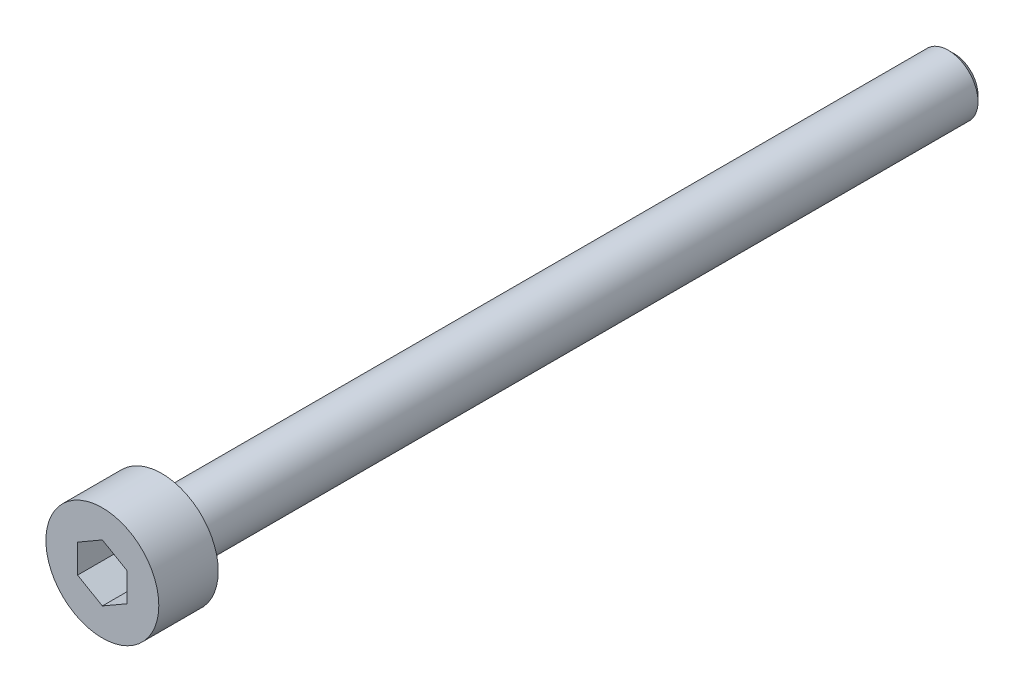
ISO-10303-21;
HEADER;
FILE_DESCRIPTION(('STEP AP214'),'2;1');
FILE_NAME('part.step','',(''),(''),'','','');
FILE_SCHEMA(('AUTOMOTIVE_DESIGN { 1 0 10303 214 1 1 1 1 }'));
ENDSEC;
DATA;
#1=APPLICATION_CONTEXT('core data for automotive mechanical design processes');
#2=APPLICATION_PROTOCOL_DEFINITION('international standard','automotive_design',2000,#1);
#3=PRODUCT_CONTEXT('',#1,'mechanical');
#4=PRODUCT('Part','Part','',(#3));
#5=PRODUCT_RELATED_PRODUCT_CATEGORY('part','',(#4));
#6=PRODUCT_DEFINITION_FORMATION('','',#4);
#7=PRODUCT_DEFINITION_CONTEXT('part definition',#1,'design');
#8=PRODUCT_DEFINITION('design','',#6,#7);
#9=PRODUCT_DEFINITION_SHAPE('','',#8);
#10=(LENGTH_UNIT() NAMED_UNIT(*) SI_UNIT(.MILLI.,.METRE.));
#11=(NAMED_UNIT(*) PLANE_ANGLE_UNIT() SI_UNIT($,.RADIAN.));
#12=(NAMED_UNIT(*) SI_UNIT($,.STERADIAN.) SOLID_ANGLE_UNIT());
#13=UNCERTAINTY_MEASURE_WITH_UNIT(LENGTH_MEASURE(1.E-05),#10,'distance_accuracy_value','');
#14=(GEOMETRIC_REPRESENTATION_CONTEXT(3) GLOBAL_UNCERTAINTY_ASSIGNED_CONTEXT((#13)) GLOBAL_UNIT_ASSIGNED_CONTEXT((#10,
#11,#12)) REPRESENTATION_CONTEXT('',''));
#15=CARTESIAN_POINT('',(0.,0.,0.));
#16=DIRECTION('',(0.,0.,1.));
#17=DIRECTION('',(1.,0.,0.));
#18=AXIS2_PLACEMENT_3D('',#15,#16,#17);
#19=CARTESIAN_POINT('',(0.,0.,0.));
#20=DIRECTION('',(0.,0.,1.));
#21=DIRECTION('',(1.,0.,0.));
#22=AXIS2_PLACEMENT_3D('',#19,#20,#21);
#23=PLANE('',#22);
#24=CARTESIAN_POINT('',(0.,0.,0.));
#25=DIRECTION('',(0.,0.,1.));
#26=DIRECTION('',(1.,0.,0.));
#27=AXIS2_PLACEMENT_3D('',#24,#25,#26);
#28=CIRCLE('',#27,2.85);
#29=CARTESIAN_POINT('',(2.85,0.,0.));
#30=VERTEX_POINT('',#29);
#31=EDGE_CURVE('E136',#30,#30,#28,.T.);
#32=ORIENTED_EDGE('',*,*,#31,.F.);
#33=EDGE_LOOP('',(#32));
#34=FACE_BOUND('',#33,.T.);
#35=CARTESIAN_POINT('',(0.,0.,0.));
#36=DIRECTION('',(0.,0.,1.));
#37=DIRECTION('',(1.,0.,0.));
#38=AXIS2_PLACEMENT_3D('',#35,#36,#37);
#39=CIRCLE('',#38,1.5);
#40=CARTESIAN_POINT('',(1.5,0.,0.));
#41=VERTEX_POINT('',#40);
#42=EDGE_CURVE('E145',#41,#41,#39,.F.);
#43=ORIENTED_EDGE('',*,*,#42,.F.);
#44=EDGE_LOOP('',(#43));
#45=FACE_BOUND('',#44,.T.);
#46=ADVANCED_FACE('F34',(#34,#45),#23,.F.);
#47=CARTESIAN_POINT('',(0.,0.,3.));
#48=DIRECTION('',(0.,0.,-1.));
#49=DIRECTION('',(-1.,0.,0.));
#50=AXIS2_PLACEMENT_3D('',#47,#48,#49);
#51=CYLINDRICAL_SURFACE('',#50,2.85);
#52=CARTESIAN_POINT('',(0.,0.,3.));
#53=DIRECTION('',(0.,0.,1.));
#54=DIRECTION('',(1.,0.,0.));
#55=AXIS2_PLACEMENT_3D('',#52,#53,#54);
#56=CIRCLE('',#55,2.85);
#57=CARTESIAN_POINT('',(2.85,0.,3.));
#58=VERTEX_POINT('',#57);
#59=EDGE_CURVE('E142',#58,#58,#56,.T.);
#60=ORIENTED_EDGE('',*,*,#59,.F.);
#61=EDGE_LOOP('',(#60));
#62=FACE_BOUND('',#61,.T.);
#63=ORIENTED_EDGE('',*,*,#31,.T.);
#64=EDGE_LOOP('',(#63));
#65=FACE_BOUND('',#64,.T.);
#66=ADVANCED_FACE('F167',(#62,#65),#51,.T.);
#67=CARTESIAN_POINT('',(0.,0.,3.));
#68=DIRECTION('',(0.,0.,1.));
#69=DIRECTION('',(1.,0.,0.));
#70=AXIS2_PLACEMENT_3D('',#67,#68,#69);
#71=PLANE('',#70);
#72=DIRECTION('',(-0.866025403784439,0.5,0.));
#73=VECTOR('',#72,1.);
#74=CARTESIAN_POINT('',(1.25,0.721687836487032,3.));
#75=LINE('',#74,#73);
#76=CARTESIAN_POINT('',(1.25,0.721687836487032,3.));
#77=VERTEX_POINT('',#76);
#78=CARTESIAN_POINT('',(0.,1.44337567297406,3.));
#79=VERTEX_POINT('',#78);
#80=EDGE_CURVE('E49',#77,#79,#75,.T.);
#81=ORIENTED_EDGE('',*,*,#80,.F.);
#82=DIRECTION('',(0.,1.,0.));
#83=VECTOR('',#82,1.);
#84=CARTESIAN_POINT('',(1.25,-0.721687836487032,3.));
#85=LINE('',#84,#83);
#86=CARTESIAN_POINT('',(1.25,-0.721687836487032,3.));
#87=VERTEX_POINT('',#86);
#88=EDGE_CURVE('E132',#87,#77,#85,.T.);
#89=ORIENTED_EDGE('',*,*,#88,.F.);
#90=DIRECTION('',(0.866025403784439,0.5,0.));
#91=VECTOR('',#90,1.);
#92=CARTESIAN_POINT('',(0.,-1.44337567297406,3.));
#93=LINE('',#92,#91);
#94=CARTESIAN_POINT('',(0.,-1.44337567297406,3.));
#95=VERTEX_POINT('',#94);
#96=EDGE_CURVE('E130',#95,#87,#93,.T.);
#97=ORIENTED_EDGE('',*,*,#96,.F.);
#98=DIRECTION('',(0.866025403784439,-0.5,0.));
#99=VECTOR('',#98,1.);
#100=CARTESIAN_POINT('',(-1.25,-0.721687836487033,3.));
#101=LINE('',#100,#99);
#102=CARTESIAN_POINT('',(-1.25,-0.721687836487033,3.));
#103=VERTEX_POINT('',#102);
#104=EDGE_CURVE('E97',#103,#95,#101,.T.);
#105=ORIENTED_EDGE('',*,*,#104,.F.);
#106=DIRECTION('',(0.,-1.,0.));
#107=VECTOR('',#106,1.);
#108=CARTESIAN_POINT('',(-1.25,0.721687836487032,3.));
#109=LINE('',#108,#107);
#110=CARTESIAN_POINT('',(-1.25,0.721687836487032,3.));
#111=VERTEX_POINT('',#110);
#112=EDGE_CURVE('E126',#111,#103,#109,.T.);
#113=ORIENTED_EDGE('',*,*,#112,.F.);
#114=DIRECTION('',(-0.866025403784439,-0.5,0.));
#115=VECTOR('',#114,1.);
#116=CARTESIAN_POINT('',(0.,1.44337567297406,3.));
#117=LINE('',#116,#115);
#118=EDGE_CURVE('E123',#79,#111,#117,.T.);
#119=ORIENTED_EDGE('',*,*,#118,.F.);
#120=EDGE_LOOP('',(#81,#89,#97,#105,#113,#119));
#121=FACE_BOUND('',#120,.T.);
#122=ORIENTED_EDGE('',*,*,#59,.T.);
#123=EDGE_LOOP('',(#122));
#124=FACE_BOUND('',#123,.T.);
#125=ADVANCED_FACE('F173',(#121,#124),#71,.T.);
#126=CARTESIAN_POINT('',(0.,0.,-40.));
#127=DIRECTION('',(0.,0.,1.));
#128=DIRECTION('',(1.,0.,0.));
#129=AXIS2_PLACEMENT_3D('',#126,#127,#128);
#130=CYLINDRICAL_SURFACE('',#129,1.5);
#131=CARTESIAN_POINT('',(0.,0.,-39.7));
#132=DIRECTION('',(0.,0.,-1.));
#133=DIRECTION('',(-1.,0.,0.));
#134=AXIS2_PLACEMENT_3D('',#131,#132,#133);
#135=CIRCLE('',#134,1.5);
#136=CARTESIAN_POINT('',(-1.5,0.,-39.7));
#137=VERTEX_POINT('',#136);
#138=EDGE_CURVE('E11',#137,#137,#135,.F.);
#139=ORIENTED_EDGE('',*,*,#138,.T.);
#140=EDGE_LOOP('',(#139));
#141=FACE_BOUND('',#140,.T.);
#142=ORIENTED_EDGE('',*,*,#42,.T.);
#143=EDGE_LOOP('',(#142));
#144=FACE_BOUND('',#143,.T.);
#145=ADVANCED_FACE('F163',(#141,#144),#130,.T.);
#146=CARTESIAN_POINT('',(0.,0.,-40.));
#147=DIRECTION('',(0.,0.,-1.));
#148=DIRECTION('',(-1.,0.,0.));
#149=AXIS2_PLACEMENT_3D('',#146,#147,#148);
#150=PLANE('',#149);
#151=CARTESIAN_POINT('',(0.,0.,-40.));
#152=DIRECTION('',(0.,0.,-1.));
#153=DIRECTION('',(-1.,0.,0.));
#154=AXIS2_PLACEMENT_3D('',#151,#152,#153);
#155=CIRCLE('',#154,1.2);
#156=CARTESIAN_POINT('',(-1.2,0.,-40.));
#157=VERTEX_POINT('',#156);
#158=EDGE_CURVE('E42',#157,#157,#155,.T.);
#159=ORIENTED_EDGE('',*,*,#158,.T.);
#160=EDGE_LOOP('',(#159));
#161=FACE_BOUND('',#160,.T.);
#162=ADVANCED_FACE('F152',(#161),#150,.T.);
#163=CARTESIAN_POINT('',(0.,0.,-40.));
#164=DIRECTION('',(0.,0.,1.));
#165=DIRECTION('',(1.,0.,0.));
#166=AXIS2_PLACEMENT_3D('',#163,#164,#165);
#167=CONICAL_SURFACE('',#166,1.2,0.785398163397423);
#168=ORIENTED_EDGE('',*,*,#138,.F.);
#169=EDGE_LOOP('',(#168));
#170=FACE_BOUND('',#169,.T.);
#171=ORIENTED_EDGE('',*,*,#158,.F.);
#172=EDGE_LOOP('',(#171));
#173=FACE_BOUND('',#172,.T.);
#174=ADVANCED_FACE('F36',(#170,#173),#167,.T.);
#175=CARTESIAN_POINT('',(1.25,0.721687836487032,1.));
#176=DIRECTION('',(0.5,0.866025403784439,0.));
#177=DIRECTION('',(-0.866025403784439,0.5,0.));
#178=AXIS2_PLACEMENT_3D('',#175,#176,#177);
#179=PLANE('',#178);
#180=ORIENTED_EDGE('',*,*,#80,.T.);
#181=DIRECTION('',(0.,0.,1.));
#182=VECTOR('',#181,1.);
#183=CARTESIAN_POINT('',(0.,1.44337567297406,1.));
#184=LINE('',#183,#182);
#185=CARTESIAN_POINT('',(0.,1.44337567297406,1.));
#186=VERTEX_POINT('',#185);
#187=EDGE_CURVE('E79',#186,#79,#184,.T.);
#188=ORIENTED_EDGE('',*,*,#187,.F.);
#189=DIRECTION('',(-0.866025403784439,0.5,0.));
#190=VECTOR('',#189,1.);
#191=CARTESIAN_POINT('',(1.25,0.721687836487032,1.));
#192=LINE('',#191,#190);
#193=CARTESIAN_POINT('',(1.25,0.721687836487032,1.));
#194=VERTEX_POINT('',#193);
#195=EDGE_CURVE('E134',#194,#186,#192,.T.);
#196=ORIENTED_EDGE('',*,*,#195,.F.);
#197=DIRECTION('',(0.,0.,1.));
#198=VECTOR('',#197,1.);
#199=CARTESIAN_POINT('',(1.25,0.721687836487032,1.));
#200=LINE('',#199,#198);
#201=EDGE_CURVE('E57',#194,#77,#200,.T.);
#202=ORIENTED_EDGE('',*,*,#201,.T.);
#203=EDGE_LOOP('',(#180,#188,#196,#202));
#204=FACE_BOUND('',#203,.T.);
#205=ADVANCED_FACE('F155',(#204),#179,.F.);
#206=CARTESIAN_POINT('',(1.25,-0.721687836487032,1.));
#207=DIRECTION('',(1.,0.,0.));
#208=DIRECTION('',(0.,1.,0.));
#209=AXIS2_PLACEMENT_3D('',#206,#207,#208);
#210=PLANE('',#209);
#211=ORIENTED_EDGE('',*,*,#88,.T.);
#212=ORIENTED_EDGE('',*,*,#201,.F.);
#213=DIRECTION('',(0.,1.,0.));
#214=VECTOR('',#213,1.);
#215=CARTESIAN_POINT('',(1.25,-0.721687836487032,1.));
#216=LINE('',#215,#214);
#217=CARTESIAN_POINT('',(1.25,-0.721687836487032,1.));
#218=VERTEX_POINT('',#217);
#219=EDGE_CURVE('E109',#218,#194,#216,.T.);
#220=ORIENTED_EDGE('',*,*,#219,.F.);
#221=DIRECTION('',(0.,0.,1.));
#222=VECTOR('',#221,1.);
#223=CARTESIAN_POINT('',(1.25,-0.721687836487032,1.));
#224=LINE('',#223,#222);
#225=EDGE_CURVE('E101',#218,#87,#224,.T.);
#226=ORIENTED_EDGE('',*,*,#225,.T.);
#227=EDGE_LOOP('',(#211,#212,#220,#226));
#228=FACE_BOUND('',#227,.T.);
#229=ADVANCED_FACE('F161',(#228),#210,.F.);
#230=CARTESIAN_POINT('',(0.,-1.44337567297406,1.));
#231=DIRECTION('',(0.5,-0.866025403784439,0.));
#232=DIRECTION('',(0.866025403784439,0.5,0.));
#233=AXIS2_PLACEMENT_3D('',#230,#231,#232);
#234=PLANE('',#233);
#235=ORIENTED_EDGE('',*,*,#96,.T.);
#236=ORIENTED_EDGE('',*,*,#225,.F.);
#237=DIRECTION('',(0.866025403784439,0.5,0.));
#238=VECTOR('',#237,1.);
#239=CARTESIAN_POINT('',(0.,-1.44337567297406,1.));
#240=LINE('',#239,#238);
#241=CARTESIAN_POINT('',(0.,-1.44337567297406,1.));
#242=VERTEX_POINT('',#241);
#243=EDGE_CURVE('E105',#242,#218,#240,.T.);
#244=ORIENTED_EDGE('',*,*,#243,.F.);
#245=DIRECTION('',(0.,0.,1.));
#246=VECTOR('',#245,1.);
#247=CARTESIAN_POINT('',(0.,-1.44337567297406,1.));
#248=LINE('',#247,#246);
#249=EDGE_CURVE('E90',#242,#95,#248,.T.);
#250=ORIENTED_EDGE('',*,*,#249,.T.);
#251=EDGE_LOOP('',(#235,#236,#244,#250));
#252=FACE_BOUND('',#251,.T.);
#253=ADVANCED_FACE('F106',(#252),#234,.F.);
#254=CARTESIAN_POINT('',(-1.25,-0.721687836487033,1.));
#255=DIRECTION('',(-0.5,-0.866025403784439,0.));
#256=DIRECTION('',(0.866025403784439,-0.5,0.));
#257=AXIS2_PLACEMENT_3D('',#254,#255,#256);
#258=PLANE('',#257);
#259=ORIENTED_EDGE('',*,*,#104,.T.);
#260=ORIENTED_EDGE('',*,*,#249,.F.);
#261=DIRECTION('',(0.866025403784439,-0.5,0.));
#262=VECTOR('',#261,1.);
#263=CARTESIAN_POINT('',(-1.25,-0.721687836487033,1.));
#264=LINE('',#263,#262);
#265=CARTESIAN_POINT('',(-1.25,-0.721687836487033,1.));
#266=VERTEX_POINT('',#265);
#267=EDGE_CURVE('E94',#266,#242,#264,.T.);
#268=ORIENTED_EDGE('',*,*,#267,.F.);
#269=DIRECTION('',(0.,0.,1.));
#270=VECTOR('',#269,1.);
#271=CARTESIAN_POINT('',(-1.25,-0.721687836487033,1.));
#272=LINE('',#271,#270);
#273=EDGE_CURVE('E102',#266,#103,#272,.T.);
#274=ORIENTED_EDGE('',*,*,#273,.T.);
#275=EDGE_LOOP('',(#259,#260,#268,#274));
#276=FACE_BOUND('',#275,.T.);
#277=ADVANCED_FACE('F92',(#276),#258,.F.);
#278=CARTESIAN_POINT('',(-1.25,0.721687836487032,1.));
#279=DIRECTION('',(-1.,0.,0.));
#280=DIRECTION('',(0.,0.,1.));
#281=AXIS2_PLACEMENT_3D('',#278,#279,#280);
#282=PLANE('',#281);
#283=ORIENTED_EDGE('',*,*,#112,.T.);
#284=ORIENTED_EDGE('',*,*,#273,.F.);
#285=DIRECTION('',(0.,-1.,0.));
#286=VECTOR('',#285,1.);
#287=CARTESIAN_POINT('',(-1.25,0.721687836487032,1.));
#288=LINE('',#287,#286);
#289=CARTESIAN_POINT('',(-1.25,0.721687836487032,1.));
#290=VERTEX_POINT('',#289);
#291=EDGE_CURVE('E115',#290,#266,#288,.T.);
#292=ORIENTED_EDGE('',*,*,#291,.F.);
#293=DIRECTION('',(0.,0.,1.));
#294=VECTOR('',#293,1.);
#295=CARTESIAN_POINT('',(-1.25,0.721687836487032,1.));
#296=LINE('',#295,#294);
#297=EDGE_CURVE('E139',#290,#111,#296,.T.);
#298=ORIENTED_EDGE('',*,*,#297,.T.);
#299=EDGE_LOOP('',(#283,#284,#292,#298));
#300=FACE_BOUND('',#299,.T.);
#301=ADVANCED_FACE('F187',(#300),#282,.F.);
#302=CARTESIAN_POINT('',(0.,1.44337567297406,1.));
#303=DIRECTION('',(-0.5,0.866025403784439,0.));
#304=DIRECTION('',(-0.866025403784439,-0.5,0.));
#305=AXIS2_PLACEMENT_3D('',#302,#303,#304);
#306=PLANE('',#305);
#307=ORIENTED_EDGE('',*,*,#118,.T.);
#308=ORIENTED_EDGE('',*,*,#297,.F.);
#309=DIRECTION('',(-0.866025403784439,-0.5,0.));
#310=VECTOR('',#309,1.);
#311=CARTESIAN_POINT('',(0.,1.44337567297406,1.));
#312=LINE('',#311,#310);
#313=EDGE_CURVE('E117',#186,#290,#312,.T.);
#314=ORIENTED_EDGE('',*,*,#313,.F.);
#315=ORIENTED_EDGE('',*,*,#187,.T.);
#316=EDGE_LOOP('',(#307,#308,#314,#315));
#317=FACE_BOUND('',#316,.T.);
#318=ADVANCED_FACE('F184',(#317),#306,.F.);
#319=CARTESIAN_POINT('',(0.,0.,1.));
#320=DIRECTION('',(0.,0.,1.));
#321=DIRECTION('',(1.,0.,0.));
#322=AXIS2_PLACEMENT_3D('',#319,#320,#321);
#323=PLANE('',#322);
#324=ORIENTED_EDGE('',*,*,#195,.T.);
#325=ORIENTED_EDGE('',*,*,#313,.T.);
#326=ORIENTED_EDGE('',*,*,#291,.T.);
#327=ORIENTED_EDGE('',*,*,#267,.T.);
#328=ORIENTED_EDGE('',*,*,#243,.T.);
#329=ORIENTED_EDGE('',*,*,#219,.T.);
#330=EDGE_LOOP('',(#324,#325,#326,#327,#328,#329));
#331=FACE_BOUND('',#330,.T.);
#332=ADVANCED_FACE('F112',(#331),#323,.T.);
#333=CLOSED_SHELL('',(#46,#66,#125,#145,#162,#174,#205,#229,#253,#277,#301,#318,#332));
#334=MANIFOLD_SOLID_BREP('B2',#333);
#335=ADVANCED_BREP_SHAPE_REPRESENTATION('',(#18,#334),#14);
#336=SHAPE_DEFINITION_REPRESENTATION(#9,#335);
ENDSEC;
END-ISO-10303-21;
